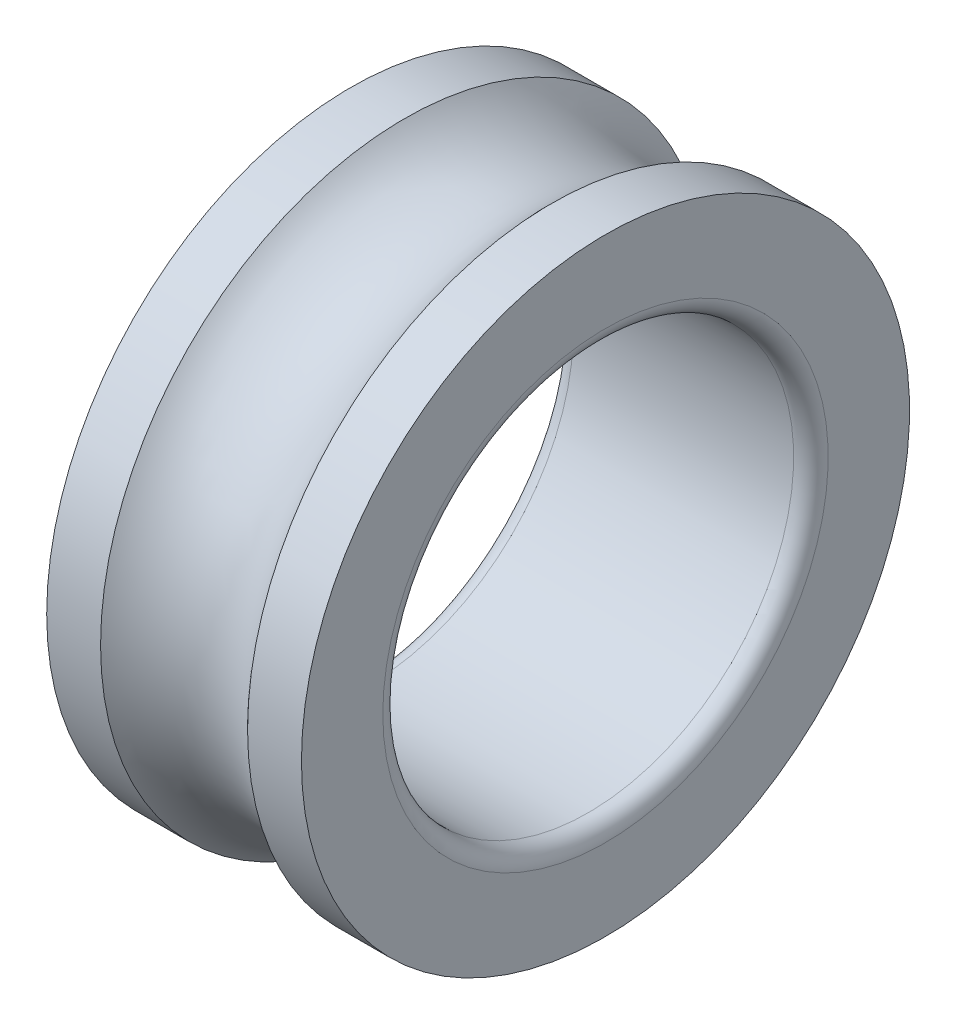
ISO-10303-21;
HEADER;
FILE_DESCRIPTION(('STEP AP214'),'2;1');
FILE_NAME('part.step','',(''),(''),'','','');
FILE_SCHEMA(('AUTOMOTIVE_DESIGN { 1 0 10303 214 1 1 1 1 }'));
ENDSEC;
DATA;
#1=APPLICATION_CONTEXT('core data for automotive mechanical design processes');
#2=APPLICATION_PROTOCOL_DEFINITION('international standard','automotive_design',2000,#1);
#3=PRODUCT_CONTEXT('',#1,'mechanical');
#4=PRODUCT('Part','Part','',(#3));
#5=PRODUCT_RELATED_PRODUCT_CATEGORY('part','',(#4));
#6=PRODUCT_DEFINITION_FORMATION('','',#4);
#7=PRODUCT_DEFINITION_CONTEXT('part definition',#1,'design');
#8=PRODUCT_DEFINITION('design','',#6,#7);
#9=PRODUCT_DEFINITION_SHAPE('','',#8);
#10=(LENGTH_UNIT() NAMED_UNIT(*) SI_UNIT(.MILLI.,.METRE.));
#11=(NAMED_UNIT(*) PLANE_ANGLE_UNIT() SI_UNIT($,.RADIAN.));
#12=(NAMED_UNIT(*) SI_UNIT($,.STERADIAN.) SOLID_ANGLE_UNIT());
#13=UNCERTAINTY_MEASURE_WITH_UNIT(LENGTH_MEASURE(1.E-05),#10,'distance_accuracy_value','');
#14=(GEOMETRIC_REPRESENTATION_CONTEXT(3) GLOBAL_UNCERTAINTY_ASSIGNED_CONTEXT((#13)) GLOBAL_UNIT_ASSIGNED_CONTEXT((#10,
#11,#12)) REPRESENTATION_CONTEXT('',''));
#15=CARTESIAN_POINT('',(0.,0.,0.));
#16=DIRECTION('',(0.,0.,1.));
#17=DIRECTION('',(1.,0.,0.));
#18=AXIS2_PLACEMENT_3D('',#15,#16,#17);
#19=CARTESIAN_POINT('',(-15.5,37.,0.));
#20=DIRECTION('',(1.,0.,0.));
#21=DIRECTION('',(0.,0.,-1.));
#22=AXIS2_PLACEMENT_3D('',#19,#20,#21);
#23=PLANE('',#22);
#24=CARTESIAN_POINT('',(-15.5,0.,0.));
#25=DIRECTION('',(-1.,0.,0.));
#26=DIRECTION('',(0.,0.,1.));
#27=AXIS2_PLACEMENT_3D('',#24,#25,#26);
#28=CIRCLE('',#27,27.1);
#29=CARTESIAN_POINT('',(-15.5,0.,27.1));
#30=VERTEX_POINT('',#29);
#31=EDGE_CURVE('E63',#30,#30,#28,.T.);
#32=ORIENTED_EDGE('',*,*,#31,.F.);
#33=EDGE_LOOP('',(#32));
#34=FACE_BOUND('',#33,.T.);
#35=CARTESIAN_POINT('',(-15.5,0.,0.));
#36=DIRECTION('',(-1.,0.,0.));
#37=DIRECTION('',(0.,0.,1.));
#38=AXIS2_PLACEMENT_3D('',#35,#36,#37);
#39=CIRCLE('',#38,37.);
#40=CARTESIAN_POINT('',(-15.5,0.,37.));
#41=VERTEX_POINT('',#40);
#42=EDGE_CURVE('E10',#41,#41,#39,.T.);
#43=ORIENTED_EDGE('',*,*,#42,.T.);
#44=EDGE_LOOP('',(#43));
#45=FACE_BOUND('',#44,.T.);
#46=ADVANCED_FACE('F35',(#34,#45),#23,.F.);
#47=CARTESIAN_POINT('',(-44.3280531568913,0.,0.));
#48=DIRECTION('',(-1.,0.,0.));
#49=DIRECTION('',(0.,0.,1.));
#50=AXIS2_PLACEMENT_3D('',#47,#48,#49);
#51=CYLINDRICAL_SURFACE('',#50,37.);
#52=ORIENTED_EDGE('',*,*,#42,.F.);
#53=EDGE_LOOP('',(#52));
#54=FACE_BOUND('',#53,.T.);
#55=CARTESIAN_POINT('',(-8.94427190999916,0.,0.));
#56=DIRECTION('',(-1.,0.,0.));
#57=DIRECTION('',(0.,0.,1.));
#58=AXIS2_PLACEMENT_3D('',#55,#56,#57);
#59=CIRCLE('',#58,37.);
#60=CARTESIAN_POINT('',(-8.94427190999916,0.,37.));
#61=VERTEX_POINT('',#60);
#62=EDGE_CURVE('E41',#61,#61,#59,.T.);
#63=ORIENTED_EDGE('',*,*,#62,.T.);
#64=EDGE_LOOP('',(#63));
#65=FACE_BOUND('',#64,.T.);
#66=ADVANCED_FACE('F70',(#54,#65),#51,.T.);
#67=CARTESIAN_POINT('',(0.,0.,0.));
#68=DIRECTION('',(-1.,0.,0.));
#69=DIRECTION('',(0.,0.,1.));
#70=AXIS2_PLACEMENT_3D('',#67,#68,#69);
#71=TOROIDAL_SURFACE('',#70,45.,12.);
#72=ORIENTED_EDGE('',*,*,#62,.F.);
#73=EDGE_LOOP('',(#72));
#74=FACE_BOUND('',#73,.T.);
#75=CARTESIAN_POINT('',(8.94427190999918,0.,0.));
#76=DIRECTION('',(-1.,0.,0.));
#77=DIRECTION('',(0.,0.,1.));
#78=AXIS2_PLACEMENT_3D('',#75,#76,#77);
#79=CIRCLE('',#78,37.);
#80=CARTESIAN_POINT('',(8.94427190999918,0.,37.));
#81=VERTEX_POINT('',#80);
#82=EDGE_CURVE('E45',#81,#81,#79,.T.);
#83=ORIENTED_EDGE('',*,*,#82,.T.);
#84=EDGE_LOOP('',(#83));
#85=FACE_BOUND('',#84,.T.);
#86=ADVANCED_FACE('F74',(#74,#85),#71,.F.);
#87=CARTESIAN_POINT('',(-44.3280531568913,0.,0.));
#88=DIRECTION('',(-1.,0.,0.));
#89=DIRECTION('',(0.,0.,1.));
#90=AXIS2_PLACEMENT_3D('',#87,#88,#89);
#91=CYLINDRICAL_SURFACE('',#90,37.);
#92=ORIENTED_EDGE('',*,*,#82,.F.);
#93=EDGE_LOOP('',(#92));
#94=FACE_BOUND('',#93,.T.);
#95=CARTESIAN_POINT('',(15.5,0.,0.));
#96=DIRECTION('',(-1.,0.,0.));
#97=DIRECTION('',(0.,0.,1.));
#98=AXIS2_PLACEMENT_3D('',#95,#96,#97);
#99=CIRCLE('',#98,37.);
#100=CARTESIAN_POINT('',(15.5,0.,37.));
#101=VERTEX_POINT('',#100);
#102=EDGE_CURVE('E49',#101,#101,#99,.T.);
#103=ORIENTED_EDGE('',*,*,#102,.T.);
#104=EDGE_LOOP('',(#103));
#105=FACE_BOUND('',#104,.T.);
#106=ADVANCED_FACE('F79',(#94,#105),#91,.T.);
#107=CARTESIAN_POINT('',(15.5,37.,0.));
#108=DIRECTION('',(-1.,0.,0.));
#109=DIRECTION('',(0.,0.,1.));
#110=AXIS2_PLACEMENT_3D('',#107,#108,#109);
#111=PLANE('',#110);
#112=ORIENTED_EDGE('',*,*,#102,.F.);
#113=EDGE_LOOP('',(#112));
#114=FACE_BOUND('',#113,.T.);
#115=CARTESIAN_POINT('',(15.5,0.,0.));
#116=DIRECTION('',(-1.,0.,0.));
#117=DIRECTION('',(0.,0.,1.));
#118=AXIS2_PLACEMENT_3D('',#115,#116,#117);
#119=CIRCLE('',#118,27.1);
#120=CARTESIAN_POINT('',(15.5,0.,27.1));
#121=VERTEX_POINT('',#120);
#122=EDGE_CURVE('E54',#121,#121,#119,.T.);
#123=ORIENTED_EDGE('',*,*,#122,.T.);
#124=EDGE_LOOP('',(#123));
#125=FACE_BOUND('',#124,.T.);
#126=ADVANCED_FACE('F85',(#114,#125),#111,.F.);
#127=CARTESIAN_POINT('',(13.4,0.,0.));
#128=DIRECTION('',(-1.,0.,0.));
#129=DIRECTION('',(0.,0.,1.));
#130=AXIS2_PLACEMENT_3D('',#127,#128,#129);
#131=TOROIDAL_SURFACE('',#130,27.1,2.1);
#132=ORIENTED_EDGE('',*,*,#122,.F.);
#133=EDGE_LOOP('',(#132));
#134=FACE_BOUND('',#133,.T.);
#135=CARTESIAN_POINT('',(13.4,0.,0.));
#136=DIRECTION('',(-1.,0.,0.));
#137=DIRECTION('',(0.,0.,1.));
#138=AXIS2_PLACEMENT_3D('',#135,#136,#137);
#139=CIRCLE('',#138,25.);
#140=CARTESIAN_POINT('',(13.4,0.,25.));
#141=VERTEX_POINT('',#140);
#142=EDGE_CURVE('E57',#141,#141,#139,.T.);
#143=ORIENTED_EDGE('',*,*,#142,.T.);
#144=EDGE_LOOP('',(#143));
#145=FACE_BOUND('',#144,.T.);
#146=ADVANCED_FACE('F89',(#134,#145),#131,.T.);
#147=CARTESIAN_POINT('',(-44.3280531568913,0.,0.));
#148=DIRECTION('',(-1.,0.,0.));
#149=DIRECTION('',(0.,0.,1.));
#150=AXIS2_PLACEMENT_3D('',#147,#148,#149);
#151=CYLINDRICAL_SURFACE('',#150,25.);
#152=ORIENTED_EDGE('',*,*,#142,.F.);
#153=EDGE_LOOP('',(#152));
#154=FACE_BOUND('',#153,.T.);
#155=CARTESIAN_POINT('',(-13.4,0.,0.));
#156=DIRECTION('',(-1.,0.,0.));
#157=DIRECTION('',(0.,0.,1.));
#158=AXIS2_PLACEMENT_3D('',#155,#156,#157);
#159=CIRCLE('',#158,25.);
#160=CARTESIAN_POINT('',(-13.4,0.,25.));
#161=VERTEX_POINT('',#160);
#162=EDGE_CURVE('E60',#161,#161,#159,.T.);
#163=ORIENTED_EDGE('',*,*,#162,.T.);
#164=EDGE_LOOP('',(#163));
#165=FACE_BOUND('',#164,.T.);
#166=ADVANCED_FACE('F93',(#154,#165),#151,.F.);
#167=CARTESIAN_POINT('',(-13.4,0.,0.));
#168=DIRECTION('',(-1.,0.,0.));
#169=DIRECTION('',(0.,0.,1.));
#170=AXIS2_PLACEMENT_3D('',#167,#168,#169);
#171=TOROIDAL_SURFACE('',#170,27.1,2.1);
#172=ORIENTED_EDGE('',*,*,#162,.F.);
#173=EDGE_LOOP('',(#172));
#174=FACE_BOUND('',#173,.T.);
#175=ORIENTED_EDGE('',*,*,#31,.T.);
#176=EDGE_LOOP('',(#175));
#177=FACE_BOUND('',#176,.T.);
#178=ADVANCED_FACE('F67',(#174,#177),#171,.T.);
#179=CLOSED_SHELL('',(#46,#66,#86,#106,#126,#146,#166,#178));
#180=MANIFOLD_SOLID_BREP('B2',#179);
#181=ADVANCED_BREP_SHAPE_REPRESENTATION('',(#18,#180),#14);
#182=SHAPE_DEFINITION_REPRESENTATION(#9,#181);
ENDSEC;
END-ISO-10303-21;
